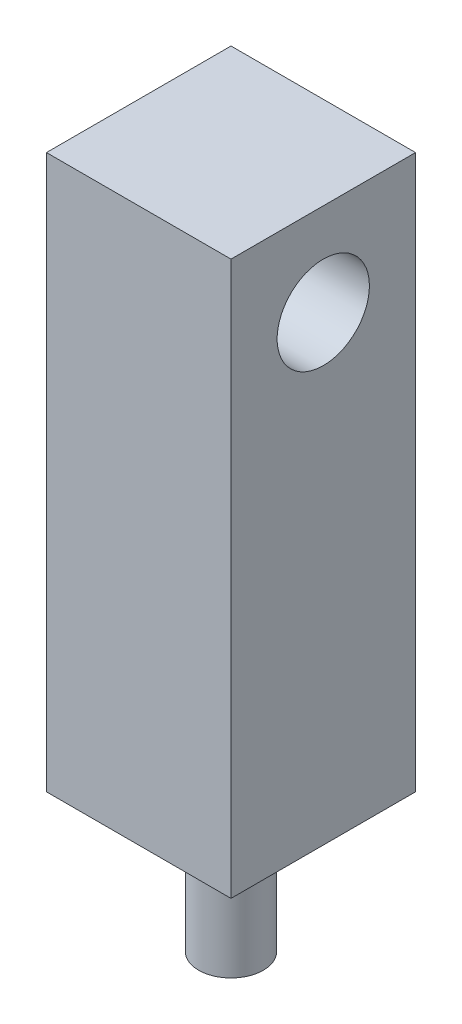
ISO-10303-21;
HEADER;
FILE_DESCRIPTION(('STEP AP214'),'2;1');
FILE_NAME('part.step','',(''),(''),'','','');
FILE_SCHEMA(('AUTOMOTIVE_DESIGN { 1 0 10303 214 1 1 1 1 }'));
ENDSEC;
DATA;
#1=APPLICATION_CONTEXT('core data for automotive mechanical design processes');
#2=APPLICATION_PROTOCOL_DEFINITION('international standard','automotive_design',2000,#1);
#3=PRODUCT_CONTEXT('',#1,'mechanical');
#4=PRODUCT('Part','Part','',(#3));
#5=PRODUCT_RELATED_PRODUCT_CATEGORY('part','',(#4));
#6=PRODUCT_DEFINITION_FORMATION('','',#4);
#7=PRODUCT_DEFINITION_CONTEXT('part definition',#1,'design');
#8=PRODUCT_DEFINITION('design','',#6,#7);
#9=PRODUCT_DEFINITION_SHAPE('','',#8);
#10=(LENGTH_UNIT() NAMED_UNIT(*) SI_UNIT(.MILLI.,.METRE.));
#11=(NAMED_UNIT(*) PLANE_ANGLE_UNIT() SI_UNIT($,.RADIAN.));
#12=(NAMED_UNIT(*) SI_UNIT($,.STERADIAN.) SOLID_ANGLE_UNIT());
#13=UNCERTAINTY_MEASURE_WITH_UNIT(LENGTH_MEASURE(1.E-05),#10,'distance_accuracy_value','');
#14=(GEOMETRIC_REPRESENTATION_CONTEXT(3) GLOBAL_UNCERTAINTY_ASSIGNED_CONTEXT((#13)) GLOBAL_UNIT_ASSIGNED_CONTEXT((#10,
#11,#12)) REPRESENTATION_CONTEXT('',''));
#15=CARTESIAN_POINT('',(0.,0.,0.));
#16=DIRECTION('',(0.,0.,1.));
#17=DIRECTION('',(1.,0.,0.));
#18=AXIS2_PLACEMENT_3D('',#15,#16,#17);
#19=CARTESIAN_POINT('',(2.,12.,-2.));
#20=DIRECTION('',(-1.,0.,0.));
#21=DIRECTION('',(0.,0.,1.));
#22=AXIS2_PLACEMENT_3D('',#19,#20,#21);
#23=PLANE('',#22);
#24=CARTESIAN_POINT('',(2.,10.,0.));
#25=DIRECTION('',(1.,0.,0.));
#26=DIRECTION('',(0.,0.,-1.));
#27=AXIS2_PLACEMENT_3D('',#24,#25,#26);
#28=CIRCLE('',#27,1.);
#29=CARTESIAN_POINT('',(2.,10.,-1.));
#30=VERTEX_POINT('',#29);
#31=EDGE_CURVE('E116',#30,#30,#28,.T.);
#32=ORIENTED_EDGE('',*,*,#31,.F.);
#33=EDGE_LOOP('',(#32));
#34=FACE_BOUND('',#33,.T.);
#35=DIRECTION('',(0.,0.,-1.));
#36=VECTOR('',#35,1.);
#37=CARTESIAN_POINT('',(2.,0.,-2.));
#38=LINE('',#37,#36);
#39=CARTESIAN_POINT('',(2.,0.,2.));
#40=VERTEX_POINT('',#39);
#41=CARTESIAN_POINT('',(2.,0.,-2.));
#42=VERTEX_POINT('',#41);
#43=EDGE_CURVE('E96',#40,#42,#38,.T.);
#44=ORIENTED_EDGE('',*,*,#43,.T.);
#45=DIRECTION('',(0.,-1.,0.));
#46=VECTOR('',#45,1.);
#47=CARTESIAN_POINT('',(2.,12.,-2.));
#48=LINE('',#47,#46);
#49=CARTESIAN_POINT('',(2.,12.,-2.));
#50=VERTEX_POINT('',#49);
#51=EDGE_CURVE('E11',#50,#42,#48,.T.);
#52=ORIENTED_EDGE('',*,*,#51,.F.);
#53=DIRECTION('',(0.,0.,-1.));
#54=VECTOR('',#53,1.);
#55=CARTESIAN_POINT('',(2.,12.,-2.));
#56=LINE('',#55,#54);
#57=CARTESIAN_POINT('',(2.,12.,2.));
#58=VERTEX_POINT('',#57);
#59=EDGE_CURVE('E84',#58,#50,#56,.T.);
#60=ORIENTED_EDGE('',*,*,#59,.F.);
#61=DIRECTION('',(0.,-1.,0.));
#62=VECTOR('',#61,1.);
#63=CARTESIAN_POINT('',(2.,12.,2.));
#64=LINE('',#63,#62);
#65=EDGE_CURVE('E92',#58,#40,#64,.T.);
#66=ORIENTED_EDGE('',*,*,#65,.T.);
#67=EDGE_LOOP('',(#44,#52,#60,#66));
#68=FACE_BOUND('',#67,.T.);
#69=ADVANCED_FACE('F33',(#34,#68),#23,.F.);
#70=CARTESIAN_POINT('',(-2.,12.,-2.));
#71=DIRECTION('',(0.,0.,1.));
#72=DIRECTION('',(1.,0.,0.));
#73=AXIS2_PLACEMENT_3D('',#70,#71,#72);
#74=PLANE('',#73);
#75=DIRECTION('',(-1.,0.,0.));
#76=VECTOR('',#75,1.);
#77=CARTESIAN_POINT('',(-2.,0.,-2.));
#78=LINE('',#77,#76);
#79=CARTESIAN_POINT('',(-2.,0.,-2.));
#80=VERTEX_POINT('',#79);
#81=EDGE_CURVE('E88',#42,#80,#78,.T.);
#82=ORIENTED_EDGE('',*,*,#81,.T.);
#83=DIRECTION('',(0.,-1.,0.));
#84=VECTOR('',#83,1.);
#85=CARTESIAN_POINT('',(-2.,12.,-2.));
#86=LINE('',#85,#84);
#87=CARTESIAN_POINT('',(-2.,12.,-2.));
#88=VERTEX_POINT('',#87);
#89=EDGE_CURVE('E41',#88,#80,#86,.T.);
#90=ORIENTED_EDGE('',*,*,#89,.F.);
#91=DIRECTION('',(-1.,0.,0.));
#92=VECTOR('',#91,1.);
#93=CARTESIAN_POINT('',(-2.,12.,-2.));
#94=LINE('',#93,#92);
#95=EDGE_CURVE('E79',#50,#88,#94,.T.);
#96=ORIENTED_EDGE('',*,*,#95,.F.);
#97=ORIENTED_EDGE('',*,*,#51,.T.);
#98=EDGE_LOOP('',(#82,#90,#96,#97));
#99=FACE_BOUND('',#98,.T.);
#100=ADVANCED_FACE('F87',(#99),#74,.F.);
#101=CARTESIAN_POINT('',(-2.,12.,-2.));
#102=DIRECTION('',(1.,0.,0.));
#103=DIRECTION('',(0.,0.,-1.));
#104=AXIS2_PLACEMENT_3D('',#101,#102,#103);
#105=PLANE('',#104);
#106=DIRECTION('',(0.,0.,1.));
#107=VECTOR('',#106,1.);
#108=CARTESIAN_POINT('',(-2.,0.,-2.));
#109=LINE('',#108,#107);
#110=CARTESIAN_POINT('',(-2.,0.,2.));
#111=VERTEX_POINT('',#110);
#112=EDGE_CURVE('E66',#80,#111,#109,.T.);
#113=ORIENTED_EDGE('',*,*,#112,.T.);
#114=DIRECTION('',(0.,-1.,0.));
#115=VECTOR('',#114,1.);
#116=CARTESIAN_POINT('',(-2.,12.,2.));
#117=LINE('',#116,#115);
#118=CARTESIAN_POINT('',(-2.,12.,2.));
#119=VERTEX_POINT('',#118);
#120=EDGE_CURVE('E89',#119,#111,#117,.T.);
#121=ORIENTED_EDGE('',*,*,#120,.F.);
#122=DIRECTION('',(0.,0.,1.));
#123=VECTOR('',#122,1.);
#124=CARTESIAN_POINT('',(-2.,12.,-2.));
#125=LINE('',#124,#123);
#126=EDGE_CURVE('E82',#88,#119,#125,.T.);
#127=ORIENTED_EDGE('',*,*,#126,.F.);
#128=ORIENTED_EDGE('',*,*,#89,.T.);
#129=EDGE_LOOP('',(#113,#121,#127,#128));
#130=FACE_BOUND('',#129,.T.);
#131=ADVANCED_FACE('F90',(#130),#105,.F.);
#132=CARTESIAN_POINT('',(-2.,12.,2.));
#133=DIRECTION('',(0.,0.,-1.));
#134=DIRECTION('',(-1.,0.,0.));
#135=AXIS2_PLACEMENT_3D('',#132,#133,#134);
#136=PLANE('',#135);
#137=DIRECTION('',(1.,0.,0.));
#138=VECTOR('',#137,1.);
#139=CARTESIAN_POINT('',(-2.,0.,2.));
#140=LINE('',#139,#138);
#141=EDGE_CURVE('E72',#111,#40,#140,.T.);
#142=ORIENTED_EDGE('',*,*,#141,.T.);
#143=ORIENTED_EDGE('',*,*,#65,.F.);
#144=DIRECTION('',(1.,0.,0.));
#145=VECTOR('',#144,1.);
#146=CARTESIAN_POINT('',(-2.,12.,2.));
#147=LINE('',#146,#145);
#148=EDGE_CURVE('E49',#119,#58,#147,.T.);
#149=ORIENTED_EDGE('',*,*,#148,.F.);
#150=ORIENTED_EDGE('',*,*,#120,.T.);
#151=EDGE_LOOP('',(#142,#143,#149,#150));
#152=FACE_BOUND('',#151,.T.);
#153=ADVANCED_FACE('F104',(#152),#136,.F.);
#154=CARTESIAN_POINT('',(0.,12.,0.));
#155=DIRECTION('',(0.,1.,0.));
#156=DIRECTION('',(0.,0.,1.));
#157=AXIS2_PLACEMENT_3D('',#154,#155,#156);
#158=PLANE('',#157);
#159=ORIENTED_EDGE('',*,*,#59,.T.);
#160=ORIENTED_EDGE('',*,*,#95,.T.);
#161=ORIENTED_EDGE('',*,*,#126,.T.);
#162=ORIENTED_EDGE('',*,*,#148,.T.);
#163=EDGE_LOOP('',(#159,#160,#161,#162));
#164=FACE_BOUND('',#163,.T.);
#165=ADVANCED_FACE('F80',(#164),#158,.T.);
#166=CARTESIAN_POINT('',(0.,0.,0.));
#167=DIRECTION('',(0.,1.,0.));
#168=DIRECTION('',(0.,0.,1.));
#169=AXIS2_PLACEMENT_3D('',#166,#167,#168);
#170=PLANE('',#169);
#171=CARTESIAN_POINT('',(0.,0.,0.));
#172=DIRECTION('',(0.,1.,0.));
#173=DIRECTION('',(0.,0.,1.));
#174=AXIS2_PLACEMENT_3D('',#171,#172,#173);
#175=CIRCLE('',#174,0.7);
#176=CARTESIAN_POINT('',(0.,0.,0.7));
#177=VERTEX_POINT('',#176);
#178=EDGE_CURVE('E110',#177,#177,#175,.T.);
#179=ORIENTED_EDGE('',*,*,#178,.T.);
#180=EDGE_LOOP('',(#179));
#181=FACE_BOUND('',#180,.T.);
#182=ORIENTED_EDGE('',*,*,#43,.F.);
#183=ORIENTED_EDGE('',*,*,#141,.F.);
#184=ORIENTED_EDGE('',*,*,#112,.F.);
#185=ORIENTED_EDGE('',*,*,#81,.F.);
#186=EDGE_LOOP('',(#182,#183,#184,#185));
#187=FACE_BOUND('',#186,.T.);
#188=ADVANCED_FACE('F107',(#181,#187),#170,.F.);
#189=CARTESIAN_POINT('',(0.,-3.,0.));
#190=DIRECTION('',(0.,1.,0.));
#191=DIRECTION('',(0.,0.,1.));
#192=AXIS2_PLACEMENT_3D('',#189,#190,#191);
#193=CYLINDRICAL_SURFACE('',#192,0.7);
#194=CARTESIAN_POINT('',(0.,-3.,0.));
#195=DIRECTION('',(0.,1.,0.));
#196=DIRECTION('',(0.,0.,1.));
#197=AXIS2_PLACEMENT_3D('',#194,#195,#196);
#198=CIRCLE('',#197,0.7);
#199=CARTESIAN_POINT('',(0.,-3.,0.7));
#200=VERTEX_POINT('',#199);
#201=EDGE_CURVE('E99',#200,#200,#198,.T.);
#202=ORIENTED_EDGE('',*,*,#201,.T.);
#203=EDGE_LOOP('',(#202));
#204=FACE_BOUND('',#203,.T.);
#205=ORIENTED_EDGE('',*,*,#178,.F.);
#206=EDGE_LOOP('',(#205));
#207=FACE_BOUND('',#206,.T.);
#208=ADVANCED_FACE('F144',(#204,#207),#193,.T.);
#209=CARTESIAN_POINT('',(0.,-3.,0.));
#210=DIRECTION('',(0.,1.,0.));
#211=DIRECTION('',(0.,0.,1.));
#212=AXIS2_PLACEMENT_3D('',#209,#210,#211);
#213=PLANE('',#212);
#214=ORIENTED_EDGE('',*,*,#201,.F.);
#215=EDGE_LOOP('',(#214));
#216=FACE_BOUND('',#215,.T.);
#217=ADVANCED_FACE('F127',(#216),#213,.F.);
#218=CARTESIAN_POINT('',(-1.,10.,0.));
#219=DIRECTION('',(1.,0.,0.));
#220=DIRECTION('',(0.,0.,-1.));
#221=AXIS2_PLACEMENT_3D('',#218,#219,#220);
#222=CYLINDRICAL_SURFACE('',#221,1.);
#223=CARTESIAN_POINT('',(-1.,10.,0.));
#224=DIRECTION('',(1.,0.,0.));
#225=DIRECTION('',(0.,0.,-1.));
#226=AXIS2_PLACEMENT_3D('',#223,#224,#225);
#227=CIRCLE('',#226,1.);
#228=CARTESIAN_POINT('',(-1.,10.,-1.));
#229=VERTEX_POINT('',#228);
#230=EDGE_CURVE('E113',#229,#229,#227,.T.);
#231=ORIENTED_EDGE('',*,*,#230,.F.);
#232=EDGE_LOOP('',(#231));
#233=FACE_BOUND('',#232,.T.);
#234=ORIENTED_EDGE('',*,*,#31,.T.);
#235=EDGE_LOOP('',(#234));
#236=FACE_BOUND('',#235,.T.);
#237=ADVANCED_FACE('F124',(#233,#236),#222,.F.);
#238=CARTESIAN_POINT('',(-1.,10.,0.));
#239=DIRECTION('',(1.,0.,0.));
#240=DIRECTION('',(0.,0.,-1.));
#241=AXIS2_PLACEMENT_3D('',#238,#239,#240);
#242=PLANE('',#241);
#243=ORIENTED_EDGE('',*,*,#230,.T.);
#244=EDGE_LOOP('',(#243));
#245=FACE_BOUND('',#244,.T.);
#246=ADVANCED_FACE('F122',(#245),#242,.T.);
#247=CLOSED_SHELL('',(#69,#100,#131,#153,#165,#188,#208,#217,#237,#246));
#248=MANIFOLD_SOLID_BREP('B2',#247);
#249=ADVANCED_BREP_SHAPE_REPRESENTATION('',(#18,#248),#14);
#250=SHAPE_DEFINITION_REPRESENTATION(#9,#249);
ENDSEC;
END-ISO-10303-21;
